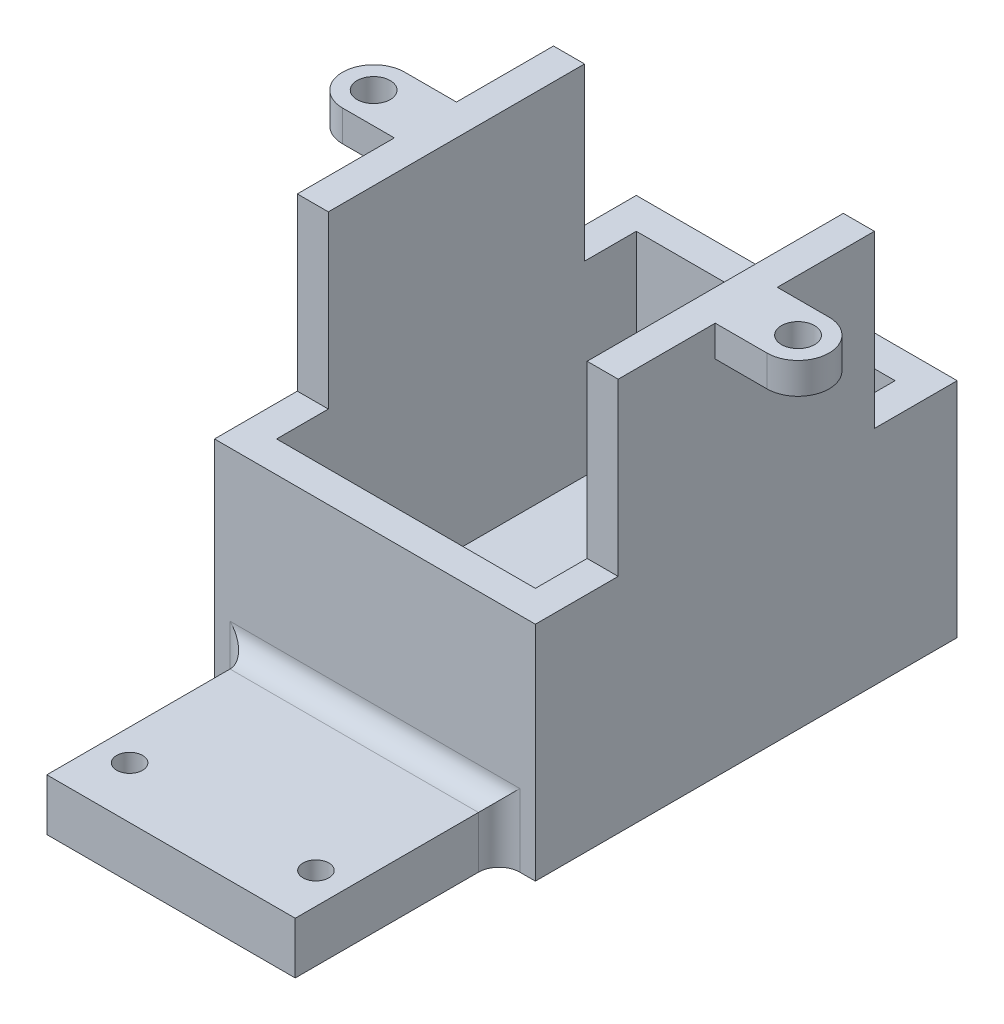
ISO-10303-21;
HEADER;
FILE_DESCRIPTION(('STEP AP214'),'2;1');
FILE_NAME('part.step','',(''),(''),'','','');
FILE_SCHEMA(('AUTOMOTIVE_DESIGN { 1 0 10303 214 1 1 1 1 }'));
ENDSEC;
DATA;
#1=APPLICATION_CONTEXT('core data for automotive mechanical design processes');
#2=APPLICATION_PROTOCOL_DEFINITION('international standard','automotive_design',2000,#1);
#3=PRODUCT_CONTEXT('',#1,'mechanical');
#4=PRODUCT('Part','Part','',(#3));
#5=PRODUCT_RELATED_PRODUCT_CATEGORY('part','',(#4));
#6=PRODUCT_DEFINITION_FORMATION('','',#4);
#7=PRODUCT_DEFINITION_CONTEXT('part definition',#1,'design');
#8=PRODUCT_DEFINITION('design','',#6,#7);
#9=PRODUCT_DEFINITION_SHAPE('','',#8);
#10=(LENGTH_UNIT() NAMED_UNIT(*) SI_UNIT(.MILLI.,.METRE.));
#11=(NAMED_UNIT(*) PLANE_ANGLE_UNIT() SI_UNIT($,.RADIAN.));
#12=(NAMED_UNIT(*) SI_UNIT($,.STERADIAN.) SOLID_ANGLE_UNIT());
#13=UNCERTAINTY_MEASURE_WITH_UNIT(LENGTH_MEASURE(1.E-05),#10,'distance_accuracy_value','');
#14=(GEOMETRIC_REPRESENTATION_CONTEXT(3) GLOBAL_UNCERTAINTY_ASSIGNED_CONTEXT((#13)) GLOBAL_UNIT_ASSIGNED_CONTEXT((#10,
#11,#12)) REPRESENTATION_CONTEXT('',''));
#15=CARTESIAN_POINT('',(0.,0.,0.));
#16=DIRECTION('',(0.,0.,1.));
#17=DIRECTION('',(1.,0.,0.));
#18=AXIS2_PLACEMENT_3D('',#15,#16,#17);
#19=CARTESIAN_POINT('',(0.,0.,0.));
#20=DIRECTION('',(0.,0.,-1.));
#21=DIRECTION('',(-1.,0.,0.));
#22=AXIS2_PLACEMENT_3D('',#19,#20,#21);
#23=PLANE('',#22);
#24=DIRECTION('',(-1.,0.,0.));
#25=VECTOR('',#24,1.);
#26=CARTESIAN_POINT('',(27.5,7.,0.));
#27=LINE('',#26,#25);
#28=CARTESIAN_POINT('',(1.5,7.,0.));
#29=VERTEX_POINT('',#28);
#30=CARTESIAN_POINT('',(29.5,7.,0.));
#31=VERTEX_POINT('',#30);
#32=EDGE_CURVE('E539',#29,#31,#27,.F.);
#33=ORIENTED_EDGE('',*,*,#32,.T.);
#34=DIRECTION('',(0.,1.,0.));
#35=VECTOR('',#34,1.);
#36=CARTESIAN_POINT('',(29.5,0.,0.));
#37=LINE('',#36,#35);
#38=CARTESIAN_POINT('',(29.5,0.,0.));
#39=VERTEX_POINT('',#38);
#40=EDGE_CURVE('E545',#31,#39,#37,.F.);
#41=ORIENTED_EDGE('',*,*,#40,.T.);
#42=DIRECTION('',(1.,0.,0.));
#43=VECTOR('',#42,1.);
#44=CARTESIAN_POINT('',(0.,0.,0.));
#45=LINE('',#44,#43);
#46=CARTESIAN_POINT('',(31.,0.,0.));
#47=VERTEX_POINT('',#46);
#48=EDGE_CURVE('E488',#39,#47,#45,.T.);
#49=ORIENTED_EDGE('',*,*,#48,.T.);
#50=DIRECTION('',(0.,1.,0.));
#51=VECTOR('',#50,1.);
#52=CARTESIAN_POINT('',(31.,0.,0.));
#53=LINE('',#52,#51);
#54=CARTESIAN_POINT('',(31.,21.5,0.));
#55=VERTEX_POINT('',#54);
#56=EDGE_CURVE('E477',#47,#55,#53,.T.);
#57=ORIENTED_EDGE('',*,*,#56,.T.);
#58=DIRECTION('',(1.,0.,0.));
#59=VECTOR('',#58,1.);
#60=CARTESIAN_POINT('',(0.,21.5,0.));
#61=LINE('',#60,#59);
#62=CARTESIAN_POINT('',(0.,21.5,0.));
#63=VERTEX_POINT('',#62);
#64=EDGE_CURVE('E262',#63,#55,#61,.T.);
#65=ORIENTED_EDGE('',*,*,#64,.F.);
#66=DIRECTION('',(0.,-1.,0.));
#67=VECTOR('',#66,1.);
#68=CARTESIAN_POINT('',(0.,0.,0.));
#69=LINE('',#68,#67);
#70=CARTESIAN_POINT('',(0.,0.,0.));
#71=VERTEX_POINT('',#70);
#72=EDGE_CURVE('E472',#63,#71,#69,.T.);
#73=ORIENTED_EDGE('',*,*,#72,.T.);
#74=CARTESIAN_POINT('',(1.5,0.,0.));
#75=VERTEX_POINT('',#74);
#76=EDGE_CURVE('E489',#71,#75,#45,.T.);
#77=ORIENTED_EDGE('',*,*,#76,.T.);
#78=DIRECTION('',(0.,-1.,0.));
#79=VECTOR('',#78,1.);
#80=CARTESIAN_POINT('',(1.5,5.,0.));
#81=LINE('',#80,#79);
#82=EDGE_CURVE('E542',#75,#29,#81,.F.);
#83=ORIENTED_EDGE('',*,*,#82,.T.);
#84=EDGE_LOOP('',(#33,#41,#49,#57,#65,#73,#77,#83));
#85=FACE_BOUND('',#84,.T.);
#86=ADVANCED_FACE('F38',(#85),#23,.F.);
#87=CARTESIAN_POINT('',(0.,38.,-40.75));
#88=DIRECTION('',(0.,1.,0.));
#89=DIRECTION('',(0.,0.,1.));
#90=AXIS2_PLACEMENT_3D('',#87,#88,#89);
#91=PLANE('',#90);
#92=CARTESIAN_POINT('',(-5.,38.,-20.375));
#93=DIRECTION('',(0.,1.,0.));
#94=DIRECTION('',(0.,0.,-1.));
#95=AXIS2_PLACEMENT_3D('',#92,#93,#94);
#96=CIRCLE('',#95,1.6);
#97=CARTESIAN_POINT('',(-5.,38.,-21.975));
#98=VERTEX_POINT('',#97);
#99=EDGE_CURVE('E305',#98,#98,#96,.T.);
#100=ORIENTED_EDGE('',*,*,#99,.F.);
#101=EDGE_LOOP('',(#100));
#102=FACE_BOUND('',#101,.T.);
#103=DIRECTION('',(0.,0.,1.));
#104=VECTOR('',#103,1.);
#105=CARTESIAN_POINT('',(0.,38.,-40.75));
#106=LINE('',#105,#104);
#107=CARTESIAN_POINT('',(0.,38.,-17.375));
#108=VERTEX_POINT('',#107);
#109=CARTESIAN_POINT('',(0.,38.,-8.));
#110=VERTEX_POINT('',#109);
#111=EDGE_CURVE('E501',#108,#110,#106,.T.);
#112=ORIENTED_EDGE('',*,*,#111,.T.);
#113=DIRECTION('',(-1.,0.,0.));
#114=VECTOR('',#113,1.);
#115=CARTESIAN_POINT('',(0.,38.,-8.));
#116=LINE('',#115,#114);
#117=CARTESIAN_POINT('',(3.,38.,-8.));
#118=VERTEX_POINT('',#117);
#119=EDGE_CURVE('E283',#118,#110,#116,.T.);
#120=ORIENTED_EDGE('',*,*,#119,.F.);
#121=DIRECTION('',(0.,0.,1.));
#122=VECTOR('',#121,1.);
#123=CARTESIAN_POINT('',(3.,38.,-3.00000000000003));
#124=LINE('',#123,#122);
#125=CARTESIAN_POINT('',(2.99999999999999,38.,-32.75));
#126=VERTEX_POINT('',#125);
#127=EDGE_CURVE('E408',#126,#118,#124,.T.);
#128=ORIENTED_EDGE('',*,*,#127,.F.);
#129=DIRECTION('',(1.,0.,0.));
#130=VECTOR('',#129,1.);
#131=CARTESIAN_POINT('',(-9.75,38.,-32.75));
#132=LINE('',#131,#130);
#133=CARTESIAN_POINT('',(0.,38.,-32.75));
#134=VERTEX_POINT('',#133);
#135=EDGE_CURVE('E463',#134,#126,#132,.T.);
#136=ORIENTED_EDGE('',*,*,#135,.F.);
#137=CARTESIAN_POINT('',(0.,38.,-23.375));
#138=VERTEX_POINT('',#137);
#139=EDGE_CURVE('E496',#134,#138,#106,.T.);
#140=ORIENTED_EDGE('',*,*,#139,.T.);
#141=DIRECTION('',(-1.,0.,0.));
#142=VECTOR('',#141,1.);
#143=CARTESIAN_POINT('',(-5.,38.,-23.375));
#144=LINE('',#143,#142);
#145=CARTESIAN_POINT('',(-5.,38.,-23.375));
#146=VERTEX_POINT('',#145);
#147=EDGE_CURVE('E310',#138,#146,#144,.T.);
#148=ORIENTED_EDGE('',*,*,#147,.T.);
#149=CARTESIAN_POINT('',(-5.,38.,-20.375));
#150=DIRECTION('',(0.,1.,0.));
#151=DIRECTION('',(0.,0.,-1.));
#152=AXIS2_PLACEMENT_3D('',#149,#150,#151);
#153=CIRCLE('',#152,3.);
#154=CARTESIAN_POINT('',(-5.,38.,-17.375));
#155=VERTEX_POINT('',#154);
#156=EDGE_CURVE('E334',#146,#155,#153,.T.);
#157=ORIENTED_EDGE('',*,*,#156,.T.);
#158=DIRECTION('',(1.,0.,0.));
#159=VECTOR('',#158,1.);
#160=CARTESIAN_POINT('',(0.,38.,-17.375));
#161=LINE('',#160,#159);
#162=EDGE_CURVE('E319',#155,#108,#161,.T.);
#163=ORIENTED_EDGE('',*,*,#162,.T.);
#164=EDGE_LOOP('',(#112,#120,#128,#136,#140,#148,#157,#163));
#165=FACE_BOUND('',#164,.T.);
#166=ADVANCED_FACE('F624',(#102,#165),#91,.T.);
#167=CARTESIAN_POINT('',(36.,38.,-20.375));
#168=DIRECTION('',(0.,1.,0.));
#169=DIRECTION('',(0.,0.,1.));
#170=AXIS2_PLACEMENT_3D('',#167,#168,#169);
#171=CIRCLE('',#170,1.6);
#172=CARTESIAN_POINT('',(36.,38.,-18.775));
#173=VERTEX_POINT('',#172);
#174=EDGE_CURVE('E345',#173,#173,#171,.T.);
#175=ORIENTED_EDGE('',*,*,#174,.F.);
#176=EDGE_LOOP('',(#175));
#177=FACE_BOUND('',#176,.T.);
#178=DIRECTION('',(0.,0.,-1.));
#179=VECTOR('',#178,1.);
#180=CARTESIAN_POINT('',(28.,38.,-3.00000000000003));
#181=LINE('',#180,#179);
#182=CARTESIAN_POINT('',(28.,38.,-8.));
#183=VERTEX_POINT('',#182);
#184=CARTESIAN_POINT('',(28.,38.,-32.75));
#185=VERTEX_POINT('',#184);
#186=EDGE_CURVE('E393',#183,#185,#181,.T.);
#187=ORIENTED_EDGE('',*,*,#186,.F.);
#188=CARTESIAN_POINT('',(31.,38.,-8.));
#189=VERTEX_POINT('',#188);
#190=EDGE_CURVE('E284',#189,#183,#116,.T.);
#191=ORIENTED_EDGE('',*,*,#190,.F.);
#192=DIRECTION('',(0.,0.,1.));
#193=VECTOR('',#192,1.);
#194=CARTESIAN_POINT('',(31.,38.,-40.75));
#195=LINE('',#194,#193);
#196=CARTESIAN_POINT('',(31.,38.,-17.375));
#197=VERTEX_POINT('',#196);
#198=EDGE_CURVE('E506',#197,#189,#195,.T.);
#199=ORIENTED_EDGE('',*,*,#198,.F.);
#200=DIRECTION('',(1.,0.,0.));
#201=VECTOR('',#200,1.);
#202=CARTESIAN_POINT('',(31.,38.,-17.375));
#203=LINE('',#202,#201);
#204=CARTESIAN_POINT('',(36.,38.,-17.375));
#205=VERTEX_POINT('',#204);
#206=EDGE_CURVE('E367',#197,#205,#203,.T.);
#207=ORIENTED_EDGE('',*,*,#206,.T.);
#208=CARTESIAN_POINT('',(36.,38.,-20.375));
#209=DIRECTION('',(0.,1.,0.));
#210=DIRECTION('',(0.,0.,1.));
#211=AXIS2_PLACEMENT_3D('',#208,#209,#210);
#212=CIRCLE('',#211,3.);
#213=CARTESIAN_POINT('',(36.,38.,-23.375));
#214=VERTEX_POINT('',#213);
#215=EDGE_CURVE('E358',#205,#214,#212,.T.);
#216=ORIENTED_EDGE('',*,*,#215,.T.);
#217=DIRECTION('',(-1.,0.,0.));
#218=VECTOR('',#217,1.);
#219=CARTESIAN_POINT('',(36.,38.,-23.375));
#220=LINE('',#219,#218);
#221=CARTESIAN_POINT('',(31.,38.,-23.375));
#222=VERTEX_POINT('',#221);
#223=EDGE_CURVE('E383',#214,#222,#220,.T.);
#224=ORIENTED_EDGE('',*,*,#223,.T.);
#225=CARTESIAN_POINT('',(31.,38.,-32.75));
#226=VERTEX_POINT('',#225);
#227=EDGE_CURVE('E502',#226,#222,#195,.T.);
#228=ORIENTED_EDGE('',*,*,#227,.F.);
#229=EDGE_CURVE('E456',#185,#226,#132,.T.);
#230=ORIENTED_EDGE('',*,*,#229,.F.);
#231=EDGE_LOOP('',(#187,#191,#199,#207,#216,#224,#228,#230));
#232=FACE_BOUND('',#231,.T.);
#233=ADVANCED_FACE('F676',(#177,#232),#91,.T.);
#234=CARTESIAN_POINT('',(-9.75,38.,-32.75));
#235=DIRECTION('',(0.,0.,1.));
#236=DIRECTION('',(0.,-1.,0.));
#237=AXIS2_PLACEMENT_3D('',#234,#235,#236);
#238=PLANE('',#237);
#239=DIRECTION('',(1.,0.,0.));
#240=VECTOR('',#239,1.);
#241=CARTESIAN_POINT('',(-9.75,21.5,-32.75));
#242=LINE('',#241,#240);
#243=CARTESIAN_POINT('',(28.,21.5,-32.75));
#244=VERTEX_POINT('',#243);
#245=CARTESIAN_POINT('',(31.,21.5,-32.75));
#246=VERTEX_POINT('',#245);
#247=EDGE_CURVE('E462',#244,#246,#242,.T.);
#248=ORIENTED_EDGE('',*,*,#247,.F.);
#249=DIRECTION('',(0.,1.,0.));
#250=VECTOR('',#249,1.);
#251=CARTESIAN_POINT('',(28.,38.,-32.75));
#252=LINE('',#251,#250);
#253=EDGE_CURVE('E520',#244,#185,#252,.T.);
#254=ORIENTED_EDGE('',*,*,#253,.T.);
#255=ORIENTED_EDGE('',*,*,#229,.T.);
#256=DIRECTION('',(0.,-1.,0.));
#257=VECTOR('',#256,1.);
#258=CARTESIAN_POINT('',(31.,38.,-32.75));
#259=LINE('',#258,#257);
#260=EDGE_CURVE('E449',#226,#246,#259,.T.);
#261=ORIENTED_EDGE('',*,*,#260,.T.);
#262=EDGE_LOOP('',(#248,#254,#255,#261));
#263=FACE_BOUND('',#262,.T.);
#264=ADVANCED_FACE('F690',(#263),#238,.F.);
#265=CARTESIAN_POINT('',(0.,0.,-40.75));
#266=DIRECTION('',(-1.,0.,0.));
#267=DIRECTION('',(0.,0.,1.));
#268=AXIS2_PLACEMENT_3D('',#265,#266,#267);
#269=PLANE('',#268);
#270=DIRECTION('',(0.,0.,1.));
#271=VECTOR('',#270,1.);
#272=CARTESIAN_POINT('',(0.,21.5,-8.));
#273=LINE('',#272,#271);
#274=CARTESIAN_POINT('',(0.,21.5,-8.));
#275=VERTEX_POINT('',#274);
#276=EDGE_CURVE('E286',#275,#63,#273,.T.);
#277=ORIENTED_EDGE('',*,*,#276,.F.);
#278=DIRECTION('',(0.,-1.,0.));
#279=VECTOR('',#278,1.);
#280=CARTESIAN_POINT('',(0.,38.,-8.));
#281=LINE('',#280,#279);
#282=EDGE_CURVE('E266',#110,#275,#281,.T.);
#283=ORIENTED_EDGE('',*,*,#282,.F.);
#284=ORIENTED_EDGE('',*,*,#111,.F.);
#285=DIRECTION('',(0.,1.,0.));
#286=VECTOR('',#285,1.);
#287=CARTESIAN_POINT('',(0.,35.,-17.375));
#288=LINE('',#287,#286);
#289=CARTESIAN_POINT('',(0.,35.,-17.375));
#290=VERTEX_POINT('',#289);
#291=EDGE_CURVE('E346',#290,#108,#288,.T.);
#292=ORIENTED_EDGE('',*,*,#291,.F.);
#293=DIRECTION('',(0.,0.,-1.));
#294=VECTOR('',#293,1.);
#295=CARTESIAN_POINT('',(0.,35.,-23.375));
#296=LINE('',#295,#294);
#297=CARTESIAN_POINT('',(0.,35.,-23.375));
#298=VERTEX_POINT('',#297);
#299=EDGE_CURVE('E326',#290,#298,#296,.T.);
#300=ORIENTED_EDGE('',*,*,#299,.T.);
#301=DIRECTION('',(0.,1.,0.));
#302=VECTOR('',#301,1.);
#303=CARTESIAN_POINT('',(0.,35.,-23.375));
#304=LINE('',#303,#302);
#305=EDGE_CURVE('E341',#298,#138,#304,.T.);
#306=ORIENTED_EDGE('',*,*,#305,.T.);
#307=ORIENTED_EDGE('',*,*,#139,.F.);
#308=DIRECTION('',(0.,1.,0.));
#309=VECTOR('',#308,1.);
#310=CARTESIAN_POINT('',(0.,0.,-32.75));
#311=LINE('',#310,#309);
#312=CARTESIAN_POINT('',(0.,21.5,-32.75));
#313=VERTEX_POINT('',#312);
#314=EDGE_CURVE('E469',#313,#134,#311,.T.);
#315=ORIENTED_EDGE('',*,*,#314,.F.);
#316=DIRECTION('',(0.,0.,1.));
#317=VECTOR('',#316,1.);
#318=CARTESIAN_POINT('',(0.,21.5,-40.75));
#319=LINE('',#318,#317);
#320=CARTESIAN_POINT('',(0.,21.5,-40.75));
#321=VERTEX_POINT('',#320);
#322=EDGE_CURVE('E461',#321,#313,#319,.T.);
#323=ORIENTED_EDGE('',*,*,#322,.F.);
#324=DIRECTION('',(0.,-1.,0.));
#325=VECTOR('',#324,1.);
#326=CARTESIAN_POINT('',(0.,0.,-40.75));
#327=LINE('',#326,#325);
#328=CARTESIAN_POINT('',(0.,0.,-40.75));
#329=VERTEX_POINT('',#328);
#330=EDGE_CURVE('E473',#321,#329,#327,.T.);
#331=ORIENTED_EDGE('',*,*,#330,.T.);
#332=DIRECTION('',(0.,0.,1.));
#333=VECTOR('',#332,1.);
#334=CARTESIAN_POINT('',(0.,0.,-40.75));
#335=LINE('',#334,#333);
#336=EDGE_CURVE('E485',#329,#71,#335,.T.);
#337=ORIENTED_EDGE('',*,*,#336,.T.);
#338=ORIENTED_EDGE('',*,*,#72,.F.);
#339=EDGE_LOOP('',(#277,#283,#284,#292,#300,#306,#307,#315,#323,#331,#337,#338));
#340=FACE_BOUND('',#339,.T.);
#341=ADVANCED_FACE('F631',(#340),#269,.T.);
#342=CARTESIAN_POINT('',(31.,0.,-40.75));
#343=DIRECTION('',(1.,0.,0.));
#344=DIRECTION('',(0.,0.,-1.));
#345=AXIS2_PLACEMENT_3D('',#342,#343,#344);
#346=PLANE('',#345);
#347=DIRECTION('',(0.,0.,1.));
#348=VECTOR('',#347,1.);
#349=CARTESIAN_POINT('',(31.,21.5,-8.));
#350=LINE('',#349,#348);
#351=CARTESIAN_POINT('',(31.,21.5,-8.));
#352=VERTEX_POINT('',#351);
#353=EDGE_CURVE('E288',#352,#55,#350,.T.);
#354=ORIENTED_EDGE('',*,*,#353,.T.);
#355=ORIENTED_EDGE('',*,*,#56,.F.);
#356=DIRECTION('',(0.,0.,1.));
#357=VECTOR('',#356,1.);
#358=CARTESIAN_POINT('',(31.,0.,-40.75));
#359=LINE('',#358,#357);
#360=CARTESIAN_POINT('',(31.,0.,-40.75));
#361=VERTEX_POINT('',#360);
#362=EDGE_CURVE('E507',#361,#47,#359,.T.);
#363=ORIENTED_EDGE('',*,*,#362,.F.);
#364=DIRECTION('',(0.,1.,0.));
#365=VECTOR('',#364,1.);
#366=CARTESIAN_POINT('',(31.,0.,-40.75));
#367=LINE('',#366,#365);
#368=CARTESIAN_POINT('',(31.,21.5,-40.75));
#369=VERTEX_POINT('',#368);
#370=EDGE_CURVE('E481',#361,#369,#367,.T.);
#371=ORIENTED_EDGE('',*,*,#370,.T.);
#372=DIRECTION('',(0.,0.,-1.));
#373=VECTOR('',#372,1.);
#374=CARTESIAN_POINT('',(31.,21.5,-40.75));
#375=LINE('',#374,#373);
#376=EDGE_CURVE('E453',#246,#369,#375,.T.);
#377=ORIENTED_EDGE('',*,*,#376,.F.);
#378=ORIENTED_EDGE('',*,*,#260,.F.);
#379=ORIENTED_EDGE('',*,*,#227,.T.);
#380=DIRECTION('',(0.,1.,0.));
#381=VECTOR('',#380,1.);
#382=CARTESIAN_POINT('',(31.,35.,-23.375));
#383=LINE('',#382,#381);
#384=CARTESIAN_POINT('',(31.,35.,-23.375));
#385=VERTEX_POINT('',#384);
#386=EDGE_CURVE('E398',#385,#222,#383,.T.);
#387=ORIENTED_EDGE('',*,*,#386,.F.);
#388=DIRECTION('',(0.,0.,1.));
#389=VECTOR('',#388,1.);
#390=CARTESIAN_POINT('',(31.,35.,-23.375));
#391=LINE('',#390,#389);
#392=CARTESIAN_POINT('',(31.,35.,-17.375));
#393=VERTEX_POINT('',#392);
#394=EDGE_CURVE('E371',#385,#393,#391,.T.);
#395=ORIENTED_EDGE('',*,*,#394,.T.);
#396=DIRECTION('',(0.,1.,0.));
#397=VECTOR('',#396,1.);
#398=CARTESIAN_POINT('',(31.,35.,-17.375));
#399=LINE('',#398,#397);
#400=EDGE_CURVE('E394',#393,#197,#399,.T.);
#401=ORIENTED_EDGE('',*,*,#400,.T.);
#402=ORIENTED_EDGE('',*,*,#198,.T.);
#403=DIRECTION('',(0.,1.,0.));
#404=VECTOR('',#403,1.);
#405=CARTESIAN_POINT('',(31.,38.,-8.));
#406=LINE('',#405,#404);
#407=EDGE_CURVE('E280',#352,#189,#406,.T.);
#408=ORIENTED_EDGE('',*,*,#407,.F.);
#409=EDGE_LOOP('',(#354,#355,#363,#371,#377,#378,#379,#387,#395,#401,#402,#408));
#410=FACE_BOUND('',#409,.T.);
#411=ADVANCED_FACE('F615',(#410),#346,.T.);
#412=CARTESIAN_POINT('',(0.,0.,-40.75));
#413=DIRECTION('',(0.,-1.,0.));
#414=DIRECTION('',(0.,0.,-1.));
#415=AXIS2_PLACEMENT_3D('',#412,#413,#414);
#416=PLANE('',#415);
#417=CARTESIAN_POINT('',(6.49999999999984,0.,14.6999999999999));
#418=DIRECTION('',(0.,-1.,0.));
#419=DIRECTION('',(0.,0.,-1.));
#420=AXIS2_PLACEMENT_3D('',#417,#418,#419);
#421=CIRCLE('',#420,1.25);
#422=CARTESIAN_POINT('',(6.49999999999984,0.,13.4499999999999));
#423=VERTEX_POINT('',#422);
#424=EDGE_CURVE('E258',#423,#423,#421,.T.);
#425=ORIENTED_EDGE('',*,*,#424,.F.);
#426=EDGE_LOOP('',(#425));
#427=FACE_BOUND('',#426,.T.);
#428=CARTESIAN_POINT('',(24.4999999999998,0.,14.6999999999999));
#429=DIRECTION('',(0.,-1.,0.));
#430=DIRECTION('',(0.,0.,-1.));
#431=AXIS2_PLACEMENT_3D('',#428,#429,#430);
#432=CIRCLE('',#431,1.25);
#433=CARTESIAN_POINT('',(24.4999999999998,0.,13.4499999999999));
#434=VERTEX_POINT('',#433);
#435=EDGE_CURVE('E573',#434,#434,#432,.T.);
#436=ORIENTED_EDGE('',*,*,#435,.F.);
#437=EDGE_LOOP('',(#436));
#438=FACE_BOUND('',#437,.T.);
#439=ORIENTED_EDGE('',*,*,#76,.F.);
#440=ORIENTED_EDGE('',*,*,#336,.F.);
#441=DIRECTION('',(1.,0.,0.));
#442=VECTOR('',#441,1.);
#443=CARTESIAN_POINT('',(0.,0.,-40.75));
#444=LINE('',#443,#442);
#445=EDGE_CURVE('E476',#329,#361,#444,.T.);
#446=ORIENTED_EDGE('',*,*,#445,.T.);
#447=ORIENTED_EDGE('',*,*,#362,.T.);
#448=ORIENTED_EDGE('',*,*,#48,.F.);
#449=CARTESIAN_POINT('',(29.5,0.,2.));
#450=DIRECTION('',(0.,-1.,0.));
#451=DIRECTION('',(0.,0.,-1.));
#452=AXIS2_PLACEMENT_3D('',#449,#450,#451);
#453=CIRCLE('',#452,2.);
#454=CARTESIAN_POINT('',(27.5,0.,2.));
#455=VERTEX_POINT('',#454);
#456=EDGE_CURVE('E48',#39,#455,#453,.F.);
#457=ORIENTED_EDGE('',*,*,#456,.T.);
#458=DIRECTION('',(0.,0.,-1.));
#459=VECTOR('',#458,1.);
#460=CARTESIAN_POINT('',(27.5,0.,19.7));
#461=LINE('',#460,#459);
#462=CARTESIAN_POINT('',(27.5,0.,19.7));
#463=VERTEX_POINT('',#462);
#464=EDGE_CURVE('E246',#463,#455,#461,.T.);
#465=ORIENTED_EDGE('',*,*,#464,.F.);
#466=DIRECTION('',(1.,0.,0.));
#467=VECTOR('',#466,1.);
#468=CARTESIAN_POINT('',(3.5,0.,19.7));
#469=LINE('',#468,#467);
#470=CARTESIAN_POINT('',(3.5,0.,19.7));
#471=VERTEX_POINT('',#470);
#472=EDGE_CURVE('E239',#471,#463,#469,.T.);
#473=ORIENTED_EDGE('',*,*,#472,.F.);
#474=DIRECTION('',(0.,0.,-1.));
#475=VECTOR('',#474,1.);
#476=CARTESIAN_POINT('',(3.5,0.,19.7));
#477=LINE('',#476,#475);
#478=CARTESIAN_POINT('',(3.5,0.,2.));
#479=VERTEX_POINT('',#478);
#480=EDGE_CURVE('E243',#471,#479,#477,.T.);
#481=ORIENTED_EDGE('',*,*,#480,.T.);
#482=CARTESIAN_POINT('',(1.5,0.,2.));
#483=DIRECTION('',(0.,-1.,0.));
#484=DIRECTION('',(0.,0.,-1.));
#485=AXIS2_PLACEMENT_3D('',#482,#483,#484);
#486=CIRCLE('',#485,2.);
#487=EDGE_CURVE('E11',#479,#75,#486,.F.);
#488=ORIENTED_EDGE('',*,*,#487,.T.);
#489=EDGE_LOOP('',(#439,#440,#446,#447,#448,#457,#465,#473,#481,#488));
#490=FACE_BOUND('',#489,.T.);
#491=ADVANCED_FACE('F242',(#427,#438,#490),#416,.T.);
#492=CARTESIAN_POINT('',(0.,0.,-40.75));
#493=DIRECTION('',(0.,0.,-1.));
#494=DIRECTION('',(-1.,0.,0.));
#495=AXIS2_PLACEMENT_3D('',#492,#493,#494);
#496=PLANE('',#495);
#497=DIRECTION('',(-1.,0.,0.));
#498=VECTOR('',#497,1.);
#499=CARTESIAN_POINT('',(0.,21.5,-40.75));
#500=LINE('',#499,#498);
#501=EDGE_CURVE('E500',#369,#321,#500,.T.);
#502=ORIENTED_EDGE('',*,*,#501,.F.);
#503=ORIENTED_EDGE('',*,*,#370,.F.);
#504=ORIENTED_EDGE('',*,*,#445,.F.);
#505=ORIENTED_EDGE('',*,*,#330,.F.);
#506=EDGE_LOOP('',(#502,#503,#504,#505));
#507=FACE_BOUND('',#506,.T.);
#508=ADVANCED_FACE('F680',(#507),#496,.T.);
#509=CARTESIAN_POINT('',(-9.75,21.5,-40.75));
#510=DIRECTION('',(0.,-1.,0.));
#511=DIRECTION('',(0.,0.,-1.));
#512=AXIS2_PLACEMENT_3D('',#509,#510,#511);
#513=PLANE('',#512);
#514=DIRECTION('',(1.,0.,0.));
#515=VECTOR('',#514,1.);
#516=CARTESIAN_POINT('',(-9.75,21.5,-37.75));
#517=LINE('',#516,#515);
#518=CARTESIAN_POINT('',(2.99999999999999,21.5,-37.75));
#519=VERTEX_POINT('',#518);
#520=CARTESIAN_POINT('',(28.,21.5,-37.75));
#521=VERTEX_POINT('',#520);
#522=EDGE_CURVE('E524',#519,#521,#517,.T.);
#523=ORIENTED_EDGE('',*,*,#522,.T.);
#524=DIRECTION('',(0.,0.,1.));
#525=VECTOR('',#524,1.);
#526=CARTESIAN_POINT('',(28.,21.5,-40.75));
#527=LINE('',#526,#525);
#528=EDGE_CURVE('E445',#521,#244,#527,.T.);
#529=ORIENTED_EDGE('',*,*,#528,.T.);
#530=ORIENTED_EDGE('',*,*,#247,.T.);
#531=ORIENTED_EDGE('',*,*,#376,.T.);
#532=ORIENTED_EDGE('',*,*,#501,.T.);
#533=ORIENTED_EDGE('',*,*,#322,.T.);
#534=CARTESIAN_POINT('',(2.99999999999999,21.5,-32.75));
#535=VERTEX_POINT('',#534);
#536=EDGE_CURVE('E457',#313,#535,#242,.T.);
#537=ORIENTED_EDGE('',*,*,#536,.T.);
#538=DIRECTION('',(0.,0.,-1.));
#539=VECTOR('',#538,1.);
#540=CARTESIAN_POINT('',(2.99999999999999,21.5,-40.75));
#541=LINE('',#540,#539);
#542=EDGE_CURVE('E430',#535,#519,#541,.T.);
#543=ORIENTED_EDGE('',*,*,#542,.T.);
#544=EDGE_LOOP('',(#523,#529,#530,#531,#532,#533,#537,#543));
#545=FACE_BOUND('',#544,.T.);
#546=ADVANCED_FACE('F715',(#545),#513,.F.);
#547=ORIENTED_EDGE('',*,*,#135,.T.);
#548=DIRECTION('',(0.,-1.,0.));
#549=VECTOR('',#548,1.);
#550=CARTESIAN_POINT('',(2.99999999999999,38.,-32.75));
#551=LINE('',#550,#549);
#552=EDGE_CURVE('E516',#126,#535,#551,.T.);
#553=ORIENTED_EDGE('',*,*,#552,.T.);
#554=ORIENTED_EDGE('',*,*,#536,.F.);
#555=ORIENTED_EDGE('',*,*,#314,.T.);
#556=EDGE_LOOP('',(#547,#553,#554,#555));
#557=FACE_BOUND('',#556,.T.);
#558=ADVANCED_FACE('F641',(#557),#238,.F.);
#559=CARTESIAN_POINT('',(2.99999999999999,3.5,-37.75));
#560=DIRECTION('',(0.,0.,-1.));
#561=DIRECTION('',(-1.,0.,0.));
#562=AXIS2_PLACEMENT_3D('',#559,#560,#561);
#563=PLANE('',#562);
#564=DIRECTION('',(0.,1.,0.));
#565=VECTOR('',#564,1.);
#566=CARTESIAN_POINT('',(2.99999999999999,3.5,-37.75));
#567=LINE('',#566,#565);
#568=CARTESIAN_POINT('',(2.99999999999999,3.5,-37.75));
#569=VERTEX_POINT('',#568);
#570=EDGE_CURVE('E435',#569,#519,#567,.T.);
#571=ORIENTED_EDGE('',*,*,#570,.F.);
#572=DIRECTION('',(-1.,0.,0.));
#573=VECTOR('',#572,1.);
#574=CARTESIAN_POINT('',(2.99999999999999,3.5,-37.75));
#575=LINE('',#574,#573);
#576=CARTESIAN_POINT('',(28.,3.5,-37.75));
#577=VERTEX_POINT('',#576);
#578=EDGE_CURVE('E407',#577,#569,#575,.T.);
#579=ORIENTED_EDGE('',*,*,#578,.F.);
#580=DIRECTION('',(0.,1.,0.));
#581=VECTOR('',#580,1.);
#582=CARTESIAN_POINT('',(28.,3.5,-37.75));
#583=LINE('',#582,#581);
#584=EDGE_CURVE('E420',#577,#521,#583,.T.);
#585=ORIENTED_EDGE('',*,*,#584,.T.);
#586=ORIENTED_EDGE('',*,*,#522,.F.);
#587=EDGE_LOOP('',(#571,#579,#585,#586));
#588=FACE_BOUND('',#587,.T.);
#589=ADVANCED_FACE('F756',(#588),#563,.F.);
#590=CARTESIAN_POINT('',(28.,3.5,-3.00000000000003));
#591=DIRECTION('',(1.,0.,0.));
#592=DIRECTION('',(0.,0.,-1.));
#593=AXIS2_PLACEMENT_3D('',#590,#591,#592);
#594=PLANE('',#593);
#595=DIRECTION('',(0.,1.,0.));
#596=VECTOR('',#595,1.);
#597=CARTESIAN_POINT('',(28.,3.5,-3.00000000000003));
#598=LINE('',#597,#596);
#599=CARTESIAN_POINT('',(28.,3.5,-3.00000000000003));
#600=VERTEX_POINT('',#599);
#601=CARTESIAN_POINT('',(28.,21.5,-3.00000000000003));
#602=VERTEX_POINT('',#601);
#603=EDGE_CURVE('E426',#600,#602,#598,.T.);
#604=ORIENTED_EDGE('',*,*,#603,.T.);
#605=DIRECTION('',(0.,0.,-1.));
#606=VECTOR('',#605,1.);
#607=CARTESIAN_POINT('',(28.,21.5,-3.00000000000003));
#608=LINE('',#607,#606);
#609=CARTESIAN_POINT('',(28.,21.5,-8.));
#610=VERTEX_POINT('',#609);
#611=EDGE_CURVE('E298',#602,#610,#608,.T.);
#612=ORIENTED_EDGE('',*,*,#611,.T.);
#613=DIRECTION('',(0.,-1.,0.));
#614=VECTOR('',#613,1.);
#615=CARTESIAN_POINT('',(28.,3.5,-8.));
#616=LINE('',#615,#614);
#617=EDGE_CURVE('E302',#183,#610,#616,.T.);
#618=ORIENTED_EDGE('',*,*,#617,.F.);
#619=ORIENTED_EDGE('',*,*,#186,.T.);
#620=ORIENTED_EDGE('',*,*,#253,.F.);
#621=ORIENTED_EDGE('',*,*,#528,.F.);
#622=ORIENTED_EDGE('',*,*,#584,.F.);
#623=DIRECTION('',(0.,0.,-1.));
#624=VECTOR('',#623,1.);
#625=CARTESIAN_POINT('',(28.,3.5,-3.00000000000003));
#626=LINE('',#625,#624);
#627=EDGE_CURVE('E403',#600,#577,#626,.T.);
#628=ORIENTED_EDGE('',*,*,#627,.F.);
#629=EDGE_LOOP('',(#604,#612,#618,#619,#620,#621,#622,#628));
#630=FACE_BOUND('',#629,.T.);
#631=ADVANCED_FACE('F755',(#630),#594,.F.);
#632=CARTESIAN_POINT('',(3.,3.5,-3.00000000000003));
#633=DIRECTION('',(-1.,0.,0.));
#634=DIRECTION('',(0.,0.,1.));
#635=AXIS2_PLACEMENT_3D('',#632,#633,#634);
#636=PLANE('',#635);
#637=DIRECTION('',(0.,1.,0.));
#638=VECTOR('',#637,1.);
#639=CARTESIAN_POINT('',(3.,3.5,-8.));
#640=LINE('',#639,#638);
#641=CARTESIAN_POINT('',(3.,21.5,-8.));
#642=VERTEX_POINT('',#641);
#643=EDGE_CURVE('E532',#642,#118,#640,.T.);
#644=ORIENTED_EDGE('',*,*,#643,.F.);
#645=DIRECTION('',(0.,0.,1.));
#646=VECTOR('',#645,1.);
#647=CARTESIAN_POINT('',(3.,21.5,-3.00000000000003));
#648=LINE('',#647,#646);
#649=CARTESIAN_POINT('',(3.,21.5,-3.00000000000003));
#650=VERTEX_POINT('',#649);
#651=EDGE_CURVE('E292',#642,#650,#648,.T.);
#652=ORIENTED_EDGE('',*,*,#651,.T.);
#653=DIRECTION('',(0.,1.,0.));
#654=VECTOR('',#653,1.);
#655=CARTESIAN_POINT('',(3.,3.5,-3.00000000000003));
#656=LINE('',#655,#654);
#657=CARTESIAN_POINT('',(3.,3.5,-3.00000000000003));
#658=VERTEX_POINT('',#657);
#659=EDGE_CURVE('E431',#658,#650,#656,.T.);
#660=ORIENTED_EDGE('',*,*,#659,.F.);
#661=DIRECTION('',(0.,0.,1.));
#662=VECTOR('',#661,1.);
#663=CARTESIAN_POINT('',(3.,3.5,-3.00000000000003));
#664=LINE('',#663,#662);
#665=EDGE_CURVE('E412',#569,#658,#664,.T.);
#666=ORIENTED_EDGE('',*,*,#665,.F.);
#667=ORIENTED_EDGE('',*,*,#570,.T.);
#668=ORIENTED_EDGE('',*,*,#542,.F.);
#669=ORIENTED_EDGE('',*,*,#552,.F.);
#670=ORIENTED_EDGE('',*,*,#127,.T.);
#671=EDGE_LOOP('',(#644,#652,#660,#666,#667,#668,#669,#670));
#672=FACE_BOUND('',#671,.T.);
#673=ADVANCED_FACE('F637',(#672),#636,.F.);
#674=CARTESIAN_POINT('',(3.,3.5,-3.00000000000003));
#675=DIRECTION('',(0.,0.,1.));
#676=DIRECTION('',(1.,0.,0.));
#677=AXIS2_PLACEMENT_3D('',#674,#675,#676);
#678=PLANE('',#677);
#679=ORIENTED_EDGE('',*,*,#659,.T.);
#680=DIRECTION('',(1.,0.,0.));
#681=VECTOR('',#680,1.);
#682=CARTESIAN_POINT('',(3.,21.5,-3.00000000000003));
#683=LINE('',#682,#681);
#684=EDGE_CURVE('E528',#650,#602,#683,.T.);
#685=ORIENTED_EDGE('',*,*,#684,.T.);
#686=ORIENTED_EDGE('',*,*,#603,.F.);
#687=DIRECTION('',(1.,0.,0.));
#688=VECTOR('',#687,1.);
#689=CARTESIAN_POINT('',(3.,3.5,-3.00000000000003));
#690=LINE('',#689,#688);
#691=EDGE_CURVE('E416',#658,#600,#690,.T.);
#692=ORIENTED_EDGE('',*,*,#691,.F.);
#693=EDGE_LOOP('',(#679,#685,#686,#692));
#694=FACE_BOUND('',#693,.T.);
#695=ADVANCED_FACE('F748',(#694),#678,.F.);
#696=CARTESIAN_POINT('',(0.,3.5,0.));
#697=DIRECTION('',(0.,-1.,0.));
#698=DIRECTION('',(0.,0.,-1.));
#699=AXIS2_PLACEMENT_3D('',#696,#697,#698);
#700=PLANE('',#699);
#701=ORIENTED_EDGE('',*,*,#627,.T.);
#702=ORIENTED_EDGE('',*,*,#578,.T.);
#703=ORIENTED_EDGE('',*,*,#665,.T.);
#704=ORIENTED_EDGE('',*,*,#691,.T.);
#705=EDGE_LOOP('',(#701,#702,#703,#704));
#706=FACE_BOUND('',#705,.T.);
#707=ADVANCED_FACE('F741',(#706),#700,.F.);
#708=CARTESIAN_POINT('',(36.,35.,-20.375));
#709=DIRECTION('',(0.,1.,0.));
#710=DIRECTION('',(0.,0.,1.));
#711=AXIS2_PLACEMENT_3D('',#708,#709,#710);
#712=CYLINDRICAL_SURFACE('',#711,3.);
#713=ORIENTED_EDGE('',*,*,#215,.F.);
#714=DIRECTION('',(0.,1.,0.));
#715=VECTOR('',#714,1.);
#716=CARTESIAN_POINT('',(36.,35.,-17.375));
#717=LINE('',#716,#715);
#718=CARTESIAN_POINT('',(36.,35.,-17.375));
#719=VERTEX_POINT('',#718);
#720=EDGE_CURVE('E390',#719,#205,#717,.T.);
#721=ORIENTED_EDGE('',*,*,#720,.F.);
#722=CARTESIAN_POINT('',(36.,35.,-20.375));
#723=DIRECTION('',(0.,1.,0.));
#724=DIRECTION('',(0.,0.,1.));
#725=AXIS2_PLACEMENT_3D('',#722,#723,#724);
#726=CIRCLE('',#725,3.);
#727=CARTESIAN_POINT('',(36.,35.,-23.375));
#728=VERTEX_POINT('',#727);
#729=EDGE_CURVE('E362',#719,#728,#726,.T.);
#730=ORIENTED_EDGE('',*,*,#729,.T.);
#731=DIRECTION('',(0.,1.,0.));
#732=VECTOR('',#731,1.);
#733=CARTESIAN_POINT('',(36.,35.,-23.375));
#734=LINE('',#733,#732);
#735=EDGE_CURVE('E379',#728,#214,#734,.T.);
#736=ORIENTED_EDGE('',*,*,#735,.T.);
#737=EDGE_LOOP('',(#713,#721,#730,#736));
#738=FACE_BOUND('',#737,.T.);
#739=ADVANCED_FACE('F731',(#738),#712,.T.);
#740=CARTESIAN_POINT('',(31.,35.,-17.375));
#741=DIRECTION('',(0.,0.,1.));
#742=DIRECTION('',(1.,0.,0.));
#743=AXIS2_PLACEMENT_3D('',#740,#741,#742);
#744=PLANE('',#743);
#745=ORIENTED_EDGE('',*,*,#206,.F.);
#746=ORIENTED_EDGE('',*,*,#400,.F.);
#747=DIRECTION('',(1.,0.,0.));
#748=VECTOR('',#747,1.);
#749=CARTESIAN_POINT('',(31.,35.,-17.375));
#750=LINE('',#749,#748);
#751=EDGE_CURVE('E375',#393,#719,#750,.T.);
#752=ORIENTED_EDGE('',*,*,#751,.T.);
#753=ORIENTED_EDGE('',*,*,#720,.T.);
#754=EDGE_LOOP('',(#745,#746,#752,#753));
#755=FACE_BOUND('',#754,.T.);
#756=ADVANCED_FACE('F733',(#755),#744,.T.);
#757=CARTESIAN_POINT('',(36.,35.,-23.375));
#758=DIRECTION('',(0.,0.,-1.));
#759=DIRECTION('',(-1.,0.,0.));
#760=AXIS2_PLACEMENT_3D('',#757,#758,#759);
#761=PLANE('',#760);
#762=ORIENTED_EDGE('',*,*,#223,.F.);
#763=ORIENTED_EDGE('',*,*,#735,.F.);
#764=DIRECTION('',(-1.,0.,0.));
#765=VECTOR('',#764,1.);
#766=CARTESIAN_POINT('',(36.,35.,-23.375));
#767=LINE('',#766,#765);
#768=EDGE_CURVE('E366',#728,#385,#767,.T.);
#769=ORIENTED_EDGE('',*,*,#768,.T.);
#770=ORIENTED_EDGE('',*,*,#386,.T.);
#771=EDGE_LOOP('',(#762,#763,#769,#770));
#772=FACE_BOUND('',#771,.T.);
#773=ADVANCED_FACE('F723',(#772),#761,.T.);
#774=CARTESIAN_POINT('',(36.,35.,-20.375));
#775=DIRECTION('',(0.,1.,0.));
#776=DIRECTION('',(0.,0.,1.));
#777=AXIS2_PLACEMENT_3D('',#774,#775,#776);
#778=PLANE('',#777);
#779=CARTESIAN_POINT('',(36.,35.,-20.375));
#780=DIRECTION('',(0.,1.,0.));
#781=DIRECTION('',(0.,0.,1.));
#782=AXIS2_PLACEMENT_3D('',#779,#780,#781);
#783=CIRCLE('',#782,1.6);
#784=CARTESIAN_POINT('',(36.,35.,-18.775));
#785=VERTEX_POINT('',#784);
#786=EDGE_CURVE('E354',#785,#785,#783,.T.);
#787=ORIENTED_EDGE('',*,*,#786,.T.);
#788=EDGE_LOOP('',(#787));
#789=FACE_BOUND('',#788,.T.);
#790=ORIENTED_EDGE('',*,*,#729,.F.);
#791=ORIENTED_EDGE('',*,*,#751,.F.);
#792=ORIENTED_EDGE('',*,*,#394,.F.);
#793=ORIENTED_EDGE('',*,*,#768,.F.);
#794=EDGE_LOOP('',(#790,#791,#792,#793));
#795=FACE_BOUND('',#794,.T.);
#796=ADVANCED_FACE('F727',(#789,#795),#778,.F.);
#797=CARTESIAN_POINT('',(36.,35.,-20.375));
#798=DIRECTION('',(0.,1.,0.));
#799=DIRECTION('',(0.,0.,1.));
#800=AXIS2_PLACEMENT_3D('',#797,#798,#799);
#801=CYLINDRICAL_SURFACE('',#800,1.6);
#802=ORIENTED_EDGE('',*,*,#786,.F.);
#803=EDGE_LOOP('',(#802));
#804=FACE_BOUND('',#803,.T.);
#805=ORIENTED_EDGE('',*,*,#174,.T.);
#806=EDGE_LOOP('',(#805));
#807=FACE_BOUND('',#806,.T.);
#808=ADVANCED_FACE('F776',(#804,#807),#801,.F.);
#809=CARTESIAN_POINT('',(-5.,35.,-23.375));
#810=DIRECTION('',(0.,0.,-1.));
#811=DIRECTION('',(-1.,0.,0.));
#812=AXIS2_PLACEMENT_3D('',#809,#810,#811);
#813=PLANE('',#812);
#814=ORIENTED_EDGE('',*,*,#147,.F.);
#815=ORIENTED_EDGE('',*,*,#305,.F.);
#816=DIRECTION('',(-1.,0.,0.));
#817=VECTOR('',#816,1.);
#818=CARTESIAN_POINT('',(-5.,35.,-23.375));
#819=LINE('',#818,#817);
#820=CARTESIAN_POINT('',(-5.,35.,-23.375));
#821=VERTEX_POINT('',#820);
#822=EDGE_CURVE('E314',#298,#821,#819,.T.);
#823=ORIENTED_EDGE('',*,*,#822,.T.);
#824=DIRECTION('',(0.,1.,0.));
#825=VECTOR('',#824,1.);
#826=CARTESIAN_POINT('',(-5.,35.,-23.375));
#827=LINE('',#826,#825);
#828=EDGE_CURVE('E330',#821,#146,#827,.T.);
#829=ORIENTED_EDGE('',*,*,#828,.T.);
#830=EDGE_LOOP('',(#814,#815,#823,#829));
#831=FACE_BOUND('',#830,.T.);
#832=ADVANCED_FACE('F648',(#831),#813,.T.);
#833=CARTESIAN_POINT('',(0.,35.,-17.375));
#834=DIRECTION('',(0.,0.,1.));
#835=DIRECTION('',(1.,0.,0.));
#836=AXIS2_PLACEMENT_3D('',#833,#834,#835);
#837=PLANE('',#836);
#838=ORIENTED_EDGE('',*,*,#162,.F.);
#839=DIRECTION('',(0.,1.,0.));
#840=VECTOR('',#839,1.);
#841=CARTESIAN_POINT('',(-5.,35.,-17.375));
#842=LINE('',#841,#840);
#843=CARTESIAN_POINT('',(-5.,35.,-17.375));
#844=VERTEX_POINT('',#843);
#845=EDGE_CURVE('E349',#844,#155,#842,.T.);
#846=ORIENTED_EDGE('',*,*,#845,.F.);
#847=DIRECTION('',(1.,0.,0.));
#848=VECTOR('',#847,1.);
#849=CARTESIAN_POINT('',(0.,35.,-17.375));
#850=LINE('',#849,#848);
#851=EDGE_CURVE('E323',#844,#290,#850,.T.);
#852=ORIENTED_EDGE('',*,*,#851,.T.);
#853=ORIENTED_EDGE('',*,*,#291,.T.);
#854=EDGE_LOOP('',(#838,#846,#852,#853));
#855=FACE_BOUND('',#854,.T.);
#856=ADVANCED_FACE('F655',(#855),#837,.T.);
#857=CARTESIAN_POINT('',(-5.,35.,-20.375));
#858=DIRECTION('',(0.,1.,0.));
#859=DIRECTION('',(0.,0.,1.));
#860=AXIS2_PLACEMENT_3D('',#857,#858,#859);
#861=CYLINDRICAL_SURFACE('',#860,3.);
#862=ORIENTED_EDGE('',*,*,#156,.F.);
#863=ORIENTED_EDGE('',*,*,#828,.F.);
#864=CARTESIAN_POINT('',(-5.,35.,-20.375));
#865=DIRECTION('',(0.,1.,0.));
#866=DIRECTION('',(0.,0.,-1.));
#867=AXIS2_PLACEMENT_3D('',#864,#865,#866);
#868=CIRCLE('',#867,3.);
#869=EDGE_CURVE('E318',#821,#844,#868,.T.);
#870=ORIENTED_EDGE('',*,*,#869,.T.);
#871=ORIENTED_EDGE('',*,*,#845,.T.);
#872=EDGE_LOOP('',(#862,#863,#870,#871));
#873=FACE_BOUND('',#872,.T.);
#874=ADVANCED_FACE('F652',(#873),#861,.T.);
#875=CARTESIAN_POINT('',(-5.,35.,-20.375));
#876=DIRECTION('',(0.,-1.,0.));
#877=DIRECTION('',(0.,0.,-1.));
#878=AXIS2_PLACEMENT_3D('',#875,#876,#877);
#879=PLANE('',#878);
#880=CARTESIAN_POINT('',(-5.,35.,-20.375));
#881=DIRECTION('',(0.,1.,0.));
#882=DIRECTION('',(0.,0.,-1.));
#883=AXIS2_PLACEMENT_3D('',#880,#881,#882);
#884=CIRCLE('',#883,1.6);
#885=CARTESIAN_POINT('',(-5.,35.,-21.975));
#886=VERTEX_POINT('',#885);
#887=EDGE_CURVE('E306',#886,#886,#884,.T.);
#888=ORIENTED_EDGE('',*,*,#887,.T.);
#889=EDGE_LOOP('',(#888));
#890=FACE_BOUND('',#889,.T.);
#891=ORIENTED_EDGE('',*,*,#822,.F.);
#892=ORIENTED_EDGE('',*,*,#299,.F.);
#893=ORIENTED_EDGE('',*,*,#851,.F.);
#894=ORIENTED_EDGE('',*,*,#869,.F.);
#895=EDGE_LOOP('',(#891,#892,#893,#894));
#896=FACE_BOUND('',#895,.T.);
#897=ADVANCED_FACE('F658',(#890,#896),#879,.T.);
#898=CARTESIAN_POINT('',(-5.,35.,-20.375));
#899=DIRECTION('',(0.,1.,0.));
#900=DIRECTION('',(0.,0.,1.));
#901=AXIS2_PLACEMENT_3D('',#898,#899,#900);
#902=CYLINDRICAL_SURFACE('',#901,1.6);
#903=ORIENTED_EDGE('',*,*,#887,.F.);
#904=EDGE_LOOP('',(#903));
#905=FACE_BOUND('',#904,.T.);
#906=ORIENTED_EDGE('',*,*,#99,.T.);
#907=EDGE_LOOP('',(#906));
#908=FACE_BOUND('',#907,.T.);
#909=ADVANCED_FACE('F660',(#905,#908),#902,.F.);
#910=CARTESIAN_POINT('',(0.,0.,-8.));
#911=DIRECTION('',(0.,0.,1.));
#912=DIRECTION('',(1.,0.,0.));
#913=AXIS2_PLACEMENT_3D('',#910,#911,#912);
#914=PLANE('',#913);
#915=ORIENTED_EDGE('',*,*,#617,.T.);
#916=DIRECTION('',(1.,0.,0.));
#917=VECTOR('',#916,1.);
#918=CARTESIAN_POINT('',(0.,21.5,-8.));
#919=LINE('',#918,#917);
#920=EDGE_CURVE('E275',#610,#352,#919,.T.);
#921=ORIENTED_EDGE('',*,*,#920,.T.);
#922=ORIENTED_EDGE('',*,*,#407,.T.);
#923=ORIENTED_EDGE('',*,*,#190,.T.);
#924=EDGE_LOOP('',(#915,#921,#922,#923));
#925=FACE_BOUND('',#924,.T.);
#926=ADVANCED_FACE('F606',(#925),#914,.T.);
#927=ORIENTED_EDGE('',*,*,#643,.T.);
#928=ORIENTED_EDGE('',*,*,#119,.T.);
#929=ORIENTED_EDGE('',*,*,#282,.T.);
#930=EDGE_CURVE('E276',#275,#642,#919,.T.);
#931=ORIENTED_EDGE('',*,*,#930,.T.);
#932=EDGE_LOOP('',(#927,#928,#929,#931));
#933=FACE_BOUND('',#932,.T.);
#934=ADVANCED_FACE('F634',(#933),#914,.T.);
#935=CARTESIAN_POINT('',(0.,21.5,-8.));
#936=DIRECTION('',(0.,-1.,0.));
#937=DIRECTION('',(0.,0.,-1.));
#938=AXIS2_PLACEMENT_3D('',#935,#936,#937);
#939=PLANE('',#938);
#940=ORIENTED_EDGE('',*,*,#684,.F.);
#941=ORIENTED_EDGE('',*,*,#651,.F.);
#942=ORIENTED_EDGE('',*,*,#930,.F.);
#943=ORIENTED_EDGE('',*,*,#276,.T.);
#944=ORIENTED_EDGE('',*,*,#64,.T.);
#945=ORIENTED_EDGE('',*,*,#353,.F.);
#946=ORIENTED_EDGE('',*,*,#920,.F.);
#947=ORIENTED_EDGE('',*,*,#611,.F.);
#948=EDGE_LOOP('',(#940,#941,#942,#943,#944,#945,#946,#947));
#949=FACE_BOUND('',#948,.T.);
#950=ADVANCED_FACE('F611',(#949),#939,.F.);
#951=CARTESIAN_POINT('',(3.5,0.,19.7));
#952=DIRECTION('',(1.,0.,0.));
#953=DIRECTION('',(0.,0.,-1.));
#954=AXIS2_PLACEMENT_3D('',#951,#952,#953);
#955=PLANE('',#954);
#956=DIRECTION('',(0.,0.,-1.));
#957=VECTOR('',#956,1.);
#958=CARTESIAN_POINT('',(3.5,5.,19.7));
#959=LINE('',#958,#957);
#960=CARTESIAN_POINT('',(3.5,5.,19.7));
#961=VERTEX_POINT('',#960);
#962=CARTESIAN_POINT('',(3.5,5.,2.));
#963=VERTEX_POINT('',#962);
#964=EDGE_CURVE('E586',#961,#963,#959,.T.);
#965=ORIENTED_EDGE('',*,*,#964,.T.);
#966=DIRECTION('',(0.,-1.,0.));
#967=VECTOR('',#966,1.);
#968=CARTESIAN_POINT('',(3.5,0.,2.));
#969=LINE('',#968,#967);
#970=EDGE_CURVE('E63',#963,#479,#969,.T.);
#971=ORIENTED_EDGE('',*,*,#970,.T.);
#972=ORIENTED_EDGE('',*,*,#480,.F.);
#973=DIRECTION('',(0.,-1.,0.));
#974=VECTOR('',#973,1.);
#975=CARTESIAN_POINT('',(3.5,0.,19.7));
#976=LINE('',#975,#974);
#977=EDGE_CURVE('E251',#961,#471,#976,.T.);
#978=ORIENTED_EDGE('',*,*,#977,.F.);
#979=EDGE_LOOP('',(#965,#971,#972,#978));
#980=FACE_BOUND('',#979,.T.);
#981=ADVANCED_FACE('F260',(#980),#955,.F.);
#982=CARTESIAN_POINT('',(27.5,0.,19.7));
#983=DIRECTION('',(-1.,0.,0.));
#984=DIRECTION('',(0.,-1.,0.));
#985=AXIS2_PLACEMENT_3D('',#982,#983,#984);
#986=PLANE('',#985);
#987=ORIENTED_EDGE('',*,*,#464,.T.);
#988=DIRECTION('',(0.,1.,0.));
#989=VECTOR('',#988,1.);
#990=CARTESIAN_POINT('',(27.5,5.,2.));
#991=LINE('',#990,#989);
#992=CARTESIAN_POINT('',(27.5,5.,2.));
#993=VERTEX_POINT('',#992);
#994=EDGE_CURVE('E535',#455,#993,#991,.T.);
#995=ORIENTED_EDGE('',*,*,#994,.T.);
#996=DIRECTION('',(0.,0.,-1.));
#997=VECTOR('',#996,1.);
#998=CARTESIAN_POINT('',(27.5,5.,19.7));
#999=LINE('',#998,#997);
#1000=CARTESIAN_POINT('',(27.5,5.,19.7));
#1001=VERTEX_POINT('',#1000);
#1002=EDGE_CURVE('E268',#1001,#993,#999,.T.);
#1003=ORIENTED_EDGE('',*,*,#1002,.F.);
#1004=DIRECTION('',(0.,1.,0.));
#1005=VECTOR('',#1004,1.);
#1006=CARTESIAN_POINT('',(27.5,0.,19.7));
#1007=LINE('',#1006,#1005);
#1008=EDGE_CURVE('E250',#463,#1001,#1007,.T.);
#1009=ORIENTED_EDGE('',*,*,#1008,.F.);
#1010=EDGE_LOOP('',(#987,#995,#1003,#1009));
#1011=FACE_BOUND('',#1010,.T.);
#1012=ADVANCED_FACE('F592',(#1011),#986,.F.);
#1013=CARTESIAN_POINT('',(3.5,5.,19.7));
#1014=DIRECTION('',(0.,-1.,0.));
#1015=DIRECTION('',(1.,0.,0.));
#1016=AXIS2_PLACEMENT_3D('',#1013,#1014,#1015);
#1017=PLANE('',#1016);
#1018=CARTESIAN_POINT('',(6.49999999999984,5.,14.6999999999999));
#1019=DIRECTION('',(0.,1.,0.));
#1020=DIRECTION('',(-1.,0.,0.));
#1021=AXIS2_PLACEMENT_3D('',#1018,#1019,#1020);
#1022=CIRCLE('',#1021,1.25);
#1023=CARTESIAN_POINT('',(5.24999999999984,5.,14.6999999999999));
#1024=VERTEX_POINT('',#1023);
#1025=EDGE_CURVE('E567',#1024,#1024,#1022,.T.);
#1026=ORIENTED_EDGE('',*,*,#1025,.F.);
#1027=EDGE_LOOP('',(#1026));
#1028=FACE_BOUND('',#1027,.T.);
#1029=CARTESIAN_POINT('',(24.4999999999998,5.,14.6999999999999));
#1030=DIRECTION('',(0.,1.,0.));
#1031=DIRECTION('',(-1.,0.,0.));
#1032=AXIS2_PLACEMENT_3D('',#1029,#1030,#1031);
#1033=CIRCLE('',#1032,1.25);
#1034=CARTESIAN_POINT('',(23.2499999999998,5.,14.6999999999999));
#1035=VERTEX_POINT('',#1034);
#1036=EDGE_CURVE('E561',#1035,#1035,#1033,.T.);
#1037=ORIENTED_EDGE('',*,*,#1036,.F.);
#1038=EDGE_LOOP('',(#1037));
#1039=FACE_BOUND('',#1038,.T.);
#1040=ORIENTED_EDGE('',*,*,#1002,.T.);
#1041=DIRECTION('',(-1.,0.,0.));
#1042=VECTOR('',#1041,1.);
#1043=CARTESIAN_POINT('',(3.5,5.,2.));
#1044=LINE('',#1043,#1042);
#1045=EDGE_CURVE('E56',#993,#963,#1044,.T.);
#1046=ORIENTED_EDGE('',*,*,#1045,.T.);
#1047=ORIENTED_EDGE('',*,*,#964,.F.);
#1048=DIRECTION('',(-1.,0.,0.));
#1049=VECTOR('',#1048,1.);
#1050=CARTESIAN_POINT('',(3.5,5.,19.7));
#1051=LINE('',#1050,#1049);
#1052=EDGE_CURVE('E256',#1001,#961,#1051,.T.);
#1053=ORIENTED_EDGE('',*,*,#1052,.F.);
#1054=EDGE_LOOP('',(#1040,#1046,#1047,#1053));
#1055=FACE_BOUND('',#1054,.T.);
#1056=ADVANCED_FACE('F590',(#1028,#1039,#1055),#1017,.F.);
#1057=CARTESIAN_POINT('',(0.,0.,19.7));
#1058=DIRECTION('',(0.,0.,-1.));
#1059=DIRECTION('',(-1.,0.,0.));
#1060=AXIS2_PLACEMENT_3D('',#1057,#1058,#1059);
#1061=PLANE('',#1060);
#1062=ORIENTED_EDGE('',*,*,#977,.T.);
#1063=ORIENTED_EDGE('',*,*,#472,.T.);
#1064=ORIENTED_EDGE('',*,*,#1008,.T.);
#1065=ORIENTED_EDGE('',*,*,#1052,.T.);
#1066=EDGE_LOOP('',(#1062,#1063,#1064,#1065));
#1067=FACE_BOUND('',#1066,.T.);
#1068=ADVANCED_FACE('F254',(#1067),#1061,.F.);
#1069=CARTESIAN_POINT('',(24.4999999999999,-15.7,14.6999999999999));
#1070=DIRECTION('',(0.,1.,0.));
#1071=DIRECTION('',(-1.,0.,0.));
#1072=AXIS2_PLACEMENT_3D('',#1069,#1070,#1071);
#1073=CYLINDRICAL_SURFACE('',#1072,1.25);
#1074=ORIENTED_EDGE('',*,*,#435,.T.);
#1075=EDGE_LOOP('',(#1074));
#1076=FACE_BOUND('',#1075,.T.);
#1077=ORIENTED_EDGE('',*,*,#1036,.T.);
#1078=EDGE_LOOP('',(#1077));
#1079=FACE_BOUND('',#1078,.T.);
#1080=ADVANCED_FACE('F702',(#1076,#1079),#1073,.F.);
#1081=CARTESIAN_POINT('',(6.49999999999984,-15.7,14.6999999999999));
#1082=DIRECTION('',(0.,1.,0.));
#1083=DIRECTION('',(-1.,0.,0.));
#1084=AXIS2_PLACEMENT_3D('',#1081,#1082,#1083);
#1085=CYLINDRICAL_SURFACE('',#1084,1.25);
#1086=ORIENTED_EDGE('',*,*,#424,.T.);
#1087=EDGE_LOOP('',(#1086));
#1088=FACE_BOUND('',#1087,.T.);
#1089=ORIENTED_EDGE('',*,*,#1025,.T.);
#1090=EDGE_LOOP('',(#1089));
#1091=FACE_BOUND('',#1090,.T.);
#1092=ADVANCED_FACE('F697',(#1088,#1091),#1085,.F.);
#1093=CARTESIAN_POINT('',(1.5,0.,2.));
#1094=DIRECTION('',(0.,1.,0.));
#1095=DIRECTION('',(0.,0.,1.));
#1096=AXIS2_PLACEMENT_3D('',#1093,#1094,#1095);
#1097=CYLINDRICAL_SURFACE('',#1096,2.);
#1098=ORIENTED_EDGE('',*,*,#487,.F.);
#1099=ORIENTED_EDGE('',*,*,#970,.F.);
#1100=CARTESIAN_POINT('',(1.5,7.,2.));
#1101=DIRECTION('',(0.707106781186547,0.707106781186548,0.));
#1102=DIRECTION('',(0.707106781186548,-0.707106781186547,0.));
#1103=AXIS2_PLACEMENT_3D('',#1100,#1101,#1102);
#1104=ELLIPSE('',#1103,2.82842712474619,2.);
#1105=EDGE_CURVE('E42',#29,#963,#1104,.F.);
#1106=ORIENTED_EDGE('',*,*,#1105,.F.);
#1107=ORIENTED_EDGE('',*,*,#82,.F.);
#1108=EDGE_LOOP('',(#1098,#1099,#1106,#1107));
#1109=FACE_BOUND('',#1108,.T.);
#1110=ADVANCED_FACE('F40',(#1109),#1097,.F.);
#1111=CARTESIAN_POINT('',(3.5,7.,2.));
#1112=DIRECTION('',(1.,0.,0.));
#1113=DIRECTION('',(0.,1.,0.));
#1114=AXIS2_PLACEMENT_3D('',#1111,#1112,#1113);
#1115=CYLINDRICAL_SURFACE('',#1114,2.);
#1116=ORIENTED_EDGE('',*,*,#1105,.T.);
#1117=ORIENTED_EDGE('',*,*,#1045,.F.);
#1118=CARTESIAN_POINT('',(29.5,7.,2.));
#1119=DIRECTION('',(0.707106781186548,-0.707106781186547,0.));
#1120=DIRECTION('',(0.707106781186547,0.707106781186548,0.));
#1121=AXIS2_PLACEMENT_3D('',#1118,#1119,#1120);
#1122=ELLIPSE('',#1121,2.82842712474619,2.);
#1123=EDGE_CURVE('E553',#31,#993,#1122,.F.);
#1124=ORIENTED_EDGE('',*,*,#1123,.F.);
#1125=ORIENTED_EDGE('',*,*,#32,.F.);
#1126=EDGE_LOOP('',(#1116,#1117,#1124,#1125));
#1127=FACE_BOUND('',#1126,.T.);
#1128=ADVANCED_FACE('F692',(#1127),#1115,.F.);
#1129=CARTESIAN_POINT('',(29.5,0.,2.));
#1130=DIRECTION('',(0.,-1.,0.));
#1131=DIRECTION('',(1.,0.,0.));
#1132=AXIS2_PLACEMENT_3D('',#1129,#1130,#1131);
#1133=CYLINDRICAL_SURFACE('',#1132,2.);
#1134=ORIENTED_EDGE('',*,*,#456,.F.);
#1135=ORIENTED_EDGE('',*,*,#40,.F.);
#1136=ORIENTED_EDGE('',*,*,#1123,.T.);
#1137=ORIENTED_EDGE('',*,*,#994,.F.);
#1138=EDGE_LOOP('',(#1134,#1135,#1136,#1137));
#1139=FACE_BOUND('',#1138,.T.);
#1140=ADVANCED_FACE('F594',(#1139),#1133,.F.);
#1141=CLOSED_SHELL('',(#86,#166,#233,#264,#341,#411,#491,#508,#546,#558,#589,#631,#673,#695,
#707,#739,#756,#773,#796,#808,#832,#856,#874,#897,#909,#926,#934,#950,#981,#1012,#1056,#1068,
#1080,#1092,#1110,#1128,#1140));
#1142=MANIFOLD_SOLID_BREP('B2',#1141);
#1143=ADVANCED_BREP_SHAPE_REPRESENTATION('',(#18,#1142),#14);
#1144=SHAPE_DEFINITION_REPRESENTATION(#9,#1143);
ENDSEC;
END-ISO-10303-21;
